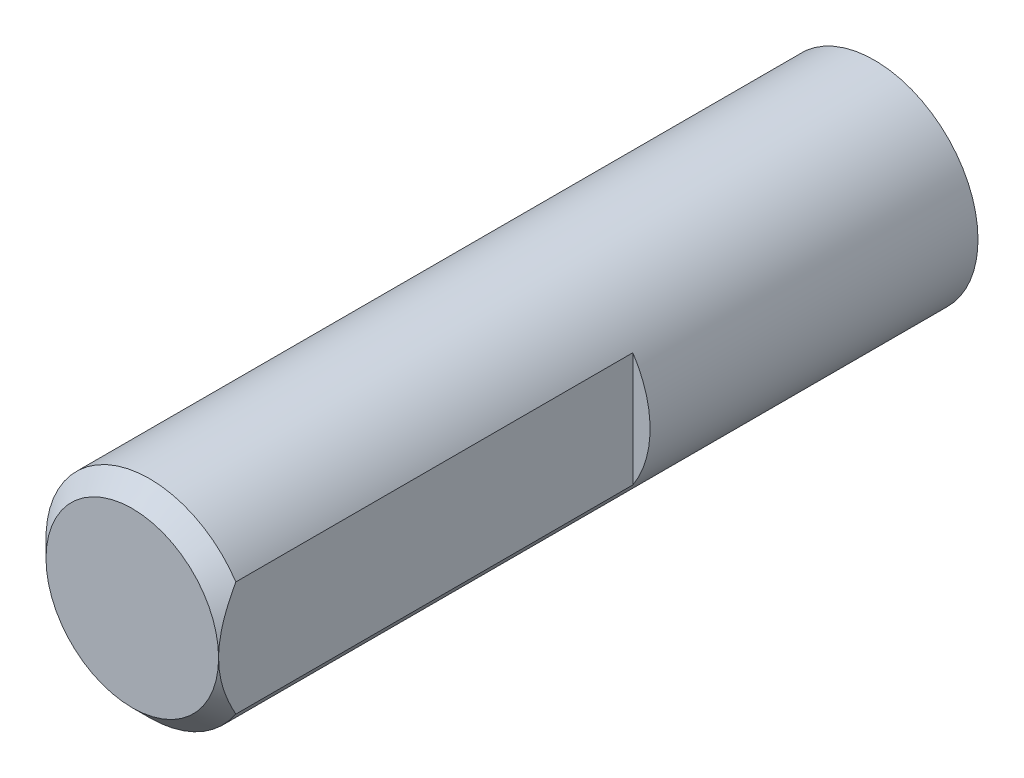
ISO-10303-21;
HEADER;
FILE_DESCRIPTION(('STEP AP214'),'2;1');
FILE_NAME('part.step','',(''),(''),'','','');
FILE_SCHEMA(('AUTOMOTIVE_DESIGN { 1 0 10303 214 1 1 1 1 }'));
ENDSEC;
DATA;
#1=APPLICATION_CONTEXT('core data for automotive mechanical design processes');
#2=APPLICATION_PROTOCOL_DEFINITION('international standard','automotive_design',2000,#1);
#3=PRODUCT_CONTEXT('',#1,'mechanical');
#4=PRODUCT('Part','Part','',(#3));
#5=PRODUCT_RELATED_PRODUCT_CATEGORY('part','',(#4));
#6=PRODUCT_DEFINITION_FORMATION('','',#4);
#7=PRODUCT_DEFINITION_CONTEXT('part definition',#1,'design');
#8=PRODUCT_DEFINITION('design','',#6,#7);
#9=PRODUCT_DEFINITION_SHAPE('','',#8);
#10=(LENGTH_UNIT() NAMED_UNIT(*) SI_UNIT(.MILLI.,.METRE.));
#11=(NAMED_UNIT(*) PLANE_ANGLE_UNIT() SI_UNIT($,.RADIAN.));
#12=(NAMED_UNIT(*) SI_UNIT($,.STERADIAN.) SOLID_ANGLE_UNIT());
#13=UNCERTAINTY_MEASURE_WITH_UNIT(LENGTH_MEASURE(1.E-05),#10,'distance_accuracy_value','');
#14=(GEOMETRIC_REPRESENTATION_CONTEXT(3) GLOBAL_UNCERTAINTY_ASSIGNED_CONTEXT((#13)) GLOBAL_UNIT_ASSIGNED_CONTEXT((#10,
#11,#12)) REPRESENTATION_CONTEXT('',''));
#15=CARTESIAN_POINT('',(0.,0.,0.));
#16=DIRECTION('',(0.,0.,1.));
#17=DIRECTION('',(1.,0.,0.));
#18=AXIS2_PLACEMENT_3D('',#15,#16,#17);
#19=CARTESIAN_POINT('',(0.,0.,21.5));
#20=DIRECTION('',(0.,0.,-1.));
#21=DIRECTION('',(-1.,0.,0.));
#22=AXIS2_PLACEMENT_3D('',#19,#20,#21);
#23=CYLINDRICAL_SURFACE('',#22,3.);
#24=DIRECTION('',(0.,0.,1.));
#25=VECTOR('',#24,1.);
#26=CARTESIAN_POINT('',(2.5,-1.6583123951777,9.5));
#27=LINE('',#26,#25);
#28=CARTESIAN_POINT('',(2.5,-1.6583123951777,9.5));
#29=VERTEX_POINT('',#28);
#30=CARTESIAN_POINT('',(2.5,-1.6583123951777,21.));
#31=VERTEX_POINT('',#30);
#32=EDGE_CURVE('E77',#29,#31,#27,.T.);
#33=ORIENTED_EDGE('',*,*,#32,.T.);
#34=CARTESIAN_POINT('',(0.,0.,21.));
#35=DIRECTION('',(0.,0.,1.));
#36=DIRECTION('',(1.,0.,0.));
#37=AXIS2_PLACEMENT_3D('',#34,#35,#36);
#38=CIRCLE('',#37,3.);
#39=CARTESIAN_POINT('',(2.5,1.6583123951777,21.));
#40=VERTEX_POINT('',#39);
#41=EDGE_CURVE('E11',#31,#40,#38,.F.);
#42=ORIENTED_EDGE('',*,*,#41,.T.);
#43=DIRECTION('',(0.,0.,1.));
#44=VECTOR('',#43,1.);
#45=CARTESIAN_POINT('',(2.5,1.6583123951777,9.5));
#46=LINE('',#45,#44);
#47=CARTESIAN_POINT('',(2.5,1.6583123951777,9.5));
#48=VERTEX_POINT('',#47);
#49=EDGE_CURVE('E75',#48,#40,#46,.T.);
#50=ORIENTED_EDGE('',*,*,#49,.F.);
#51=CARTESIAN_POINT('',(0.,0.,9.5));
#52=DIRECTION('',(0.,0.,1.));
#53=DIRECTION('',(1.,0.,0.));
#54=AXIS2_PLACEMENT_3D('',#51,#52,#53);
#55=CIRCLE('',#54,3.);
#56=EDGE_CURVE('E68',#29,#48,#55,.T.);
#57=ORIENTED_EDGE('',*,*,#56,.F.);
#58=EDGE_LOOP('',(#33,#42,#50,#57));
#59=FACE_BOUND('',#58,.T.);
#60=CARTESIAN_POINT('',(0.,0.,0.));
#61=DIRECTION('',(0.,0.,1.));
#62=DIRECTION('',(1.,0.,0.));
#63=AXIS2_PLACEMENT_3D('',#60,#61,#62);
#64=CIRCLE('',#63,3.);
#65=CARTESIAN_POINT('',(3.,0.,0.));
#66=VERTEX_POINT('',#65);
#67=EDGE_CURVE('E86',#66,#66,#64,.T.);
#68=ORIENTED_EDGE('',*,*,#67,.T.);
#69=EDGE_LOOP('',(#68));
#70=FACE_BOUND('',#69,.T.);
#71=ADVANCED_FACE('F36',(#59,#70),#23,.T.);
#72=CARTESIAN_POINT('',(0.,0.,21.5));
#73=DIRECTION('',(0.,0.,1.));
#74=DIRECTION('',(1.,0.,0.));
#75=AXIS2_PLACEMENT_3D('',#72,#73,#74);
#76=PLANE('',#75);
#77=CARTESIAN_POINT('',(0.,0.,21.5));
#78=DIRECTION('',(0.,0.,1.));
#79=DIRECTION('',(1.,0.,0.));
#80=AXIS2_PLACEMENT_3D('',#77,#78,#79);
#81=CIRCLE('',#80,2.5);
#82=CARTESIAN_POINT('',(2.5,0.,21.5));
#83=VERTEX_POINT('',#82);
#84=EDGE_CURVE('E92',#83,#83,#81,.T.);
#85=ORIENTED_EDGE('',*,*,#84,.T.);
#86=EDGE_LOOP('',(#85));
#87=FACE_BOUND('',#86,.T.);
#88=ADVANCED_FACE('F111',(#87),#76,.T.);
#89=CARTESIAN_POINT('',(0.,0.,0.));
#90=DIRECTION('',(0.,0.,1.));
#91=DIRECTION('',(1.,0.,0.));
#92=AXIS2_PLACEMENT_3D('',#89,#90,#91);
#93=PLANE('',#92);
#94=ORIENTED_EDGE('',*,*,#67,.F.);
#95=EDGE_LOOP('',(#94));
#96=FACE_BOUND('',#95,.T.);
#97=ADVANCED_FACE('F110',(#96),#93,.F.);
#98=CARTESIAN_POINT('',(2.5,1.6583123951777,9.5));
#99=DIRECTION('',(-1.,0.,0.));
#100=DIRECTION('',(0.,0.,1.));
#101=AXIS2_PLACEMENT_3D('',#98,#99,#100);
#102=PLANE('',#101);
#103=CARTESIAN_POINT('',(2.5,1.6583123951777,21.));
#104=CARTESIAN_POINT('',(2.5,1.61304419071273,21.0250200255843));
#105=CARTESIAN_POINT('',(2.5,1.56747781751027,21.049499427219));
#106=CARTESIAN_POINT('',(2.5,1.47571363154993,21.0972096867305));
#107=CARTESIAN_POINT('',(2.5,1.42951600534284,21.1204409038781));
#108=CARTESIAN_POINT('',(2.5,1.28946898250347,21.188233741468));
#109=CARTESIAN_POINT('',(2.5,1.19456817295725,21.2306685534991));
#110=CARTESIAN_POINT('',(2.5,1.00435832661106,21.3071641313579));
#111=CARTESIAN_POINT('',(2.5,0.909128166857117,21.3414185932365));
#112=CARTESIAN_POINT('',(2.5,0.715960996402805,21.4011186383457));
#113=CARTESIAN_POINT('',(2.5,0.618025975916641,21.4265705213043));
#114=CARTESIAN_POINT('',(2.5,0.434096531038006,21.46395141614));
#115=CARTESIAN_POINT('',(2.5,0.348395131920399,21.4772928993308));
#116=CARTESIAN_POINT('',(2.5,0.218706232970867,21.4908266543301));
#117=CARTESIAN_POINT('',(2.5,0.17504227488708,21.4942588205655));
#118=CARTESIAN_POINT('',(2.5,0.0875881850216984,21.4988484547413));
#119=CARTESIAN_POINT('',(2.5,0.0437980337548221,21.5000055502065));
#120=CARTESIAN_POINT('',(2.5,0.,21.5));
#121=B_SPLINE_CURVE_WITH_KNOTS('',3,(#103,#104,#105,#106,#107,#108,#109,#110,#111,#112,#113,
#114,#115,#116,#117,#118,#119,#120),.UNSPECIFIED.,.F.,.F.,(4,2,2,2,2,2,2,2,4),(0.,
0.155160114661541,0.310275326953931,0.621889187467566,0.925164565305232,1.22822244720193,
1.48798349653102,1.61932602447731,1.75069005406606),.UNSPECIFIED.);
#122=EDGE_CURVE('E95',#40,#83,#121,.T.);
#123=ORIENTED_EDGE('',*,*,#122,.T.);
#124=CARTESIAN_POINT('',(2.5,0.,21.5));
#125=CARTESIAN_POINT('',(2.5,-0.0768428391803911,21.5000643176381));
#126=CARTESIAN_POINT('',(2.5,-0.153646619440305,21.4964585669139));
#127=CARTESIAN_POINT('',(2.5,-0.306486913990631,21.4824138186156));
#128=CARTESIAN_POINT('',(2.5,-0.382524604614592,21.4719877566791));
#129=CARTESIAN_POINT('',(2.5,-0.532231201598341,21.4450231886171));
#130=CARTESIAN_POINT('',(2.5,-0.605918543015125,21.4285851348585));
#131=CARTESIAN_POINT('',(2.5,-0.751897163106768,21.3903277696489));
#132=CARTESIAN_POINT('',(2.5,-0.824187885624651,21.3685063602176));
#133=CARTESIAN_POINT('',(2.5,-0.961361204559369,21.3222417065684));
#134=CARTESIAN_POINT('',(2.5,-1.02636662586387,21.2981581621012));
#135=CARTESIAN_POINT('',(2.5,-1.15505562355539,21.2466971992364));
#136=CARTESIAN_POINT('',(2.5,-1.21873914323977,21.2193196398836));
#137=CARTESIAN_POINT('',(2.5,-1.34581351001767,21.1613450460911));
#138=CARTESIAN_POINT('',(2.5,-1.40918435962136,21.1307045192353));
#139=CARTESIAN_POINT('',(2.5,-1.53466113602633,21.067035036112));
#140=CARTESIAN_POINT('',(2.5,-1.59676793059763,21.0340077944289));
#141=CARTESIAN_POINT('',(2.5,-1.6583123951777,21.));
#142=B_SPLINE_CURVE_WITH_KNOTS('',3,(#124,#125,#126,#127,#128,#129,#130,#131,#132,#133,#134,
#135,#136,#137,#138,#139,#140,#141),.UNSPECIFIED.,.F.,.F.,(4,2,2,2,2,2,2,2,4),(0.,
0.230381722715165,0.460327757459297,0.686595219702824,0.912951001700758,1.120819357645,
1.32869661170077,1.53981070703045,1.75077462023261),.UNSPECIFIED.);
#143=EDGE_CURVE('E46',#83,#31,#142,.T.);
#144=ORIENTED_EDGE('',*,*,#143,.T.);
#145=ORIENTED_EDGE('',*,*,#32,.F.);
#146=DIRECTION('',(0.,-1.,0.));
#147=VECTOR('',#146,1.);
#148=CARTESIAN_POINT('',(2.5,1.6583123951777,9.5));
#149=LINE('',#148,#147);
#150=EDGE_CURVE('E71',#48,#29,#149,.T.);
#151=ORIENTED_EDGE('',*,*,#150,.F.);
#152=ORIENTED_EDGE('',*,*,#49,.T.);
#153=EDGE_LOOP('',(#123,#144,#145,#151,#152));
#154=FACE_BOUND('',#153,.T.);
#155=ADVANCED_FACE('F74',(#154),#102,.F.);
#156=CARTESIAN_POINT('',(0.,0.,9.5));
#157=DIRECTION('',(0.,0.,1.));
#158=DIRECTION('',(1.,0.,0.));
#159=AXIS2_PLACEMENT_3D('',#156,#157,#158);
#160=PLANE('',#159);
#161=ORIENTED_EDGE('',*,*,#56,.T.);
#162=ORIENTED_EDGE('',*,*,#150,.T.);
#163=EDGE_LOOP('',(#161,#162));
#164=FACE_BOUND('',#163,.T.);
#165=ADVANCED_FACE('F70',(#164),#160,.T.);
#166=CARTESIAN_POINT('',(0.,0.,21.5));
#167=DIRECTION('',(0.,0.,-1.));
#168=DIRECTION('',(-1.,0.,0.));
#169=AXIS2_PLACEMENT_3D('',#166,#167,#168);
#170=CONICAL_SURFACE('',#169,2.5,0.78539816339745);
#171=ORIENTED_EDGE('',*,*,#122,.F.);
#172=ORIENTED_EDGE('',*,*,#41,.F.);
#173=ORIENTED_EDGE('',*,*,#143,.F.);
#174=ORIENTED_EDGE('',*,*,#84,.F.);
#175=EDGE_LOOP('',(#171,#172,#173,#174));
#176=FACE_BOUND('',#175,.T.);
#177=ADVANCED_FACE('F38',(#176),#170,.T.);
#178=CLOSED_SHELL('',(#71,#88,#97,#155,#165,#177));
#179=MANIFOLD_SOLID_BREP('B2',#178);
#180=ADVANCED_BREP_SHAPE_REPRESENTATION('',(#18,#179),#14);
#181=SHAPE_DEFINITION_REPRESENTATION(#9,#180);
ENDSEC;
END-ISO-10303-21;
